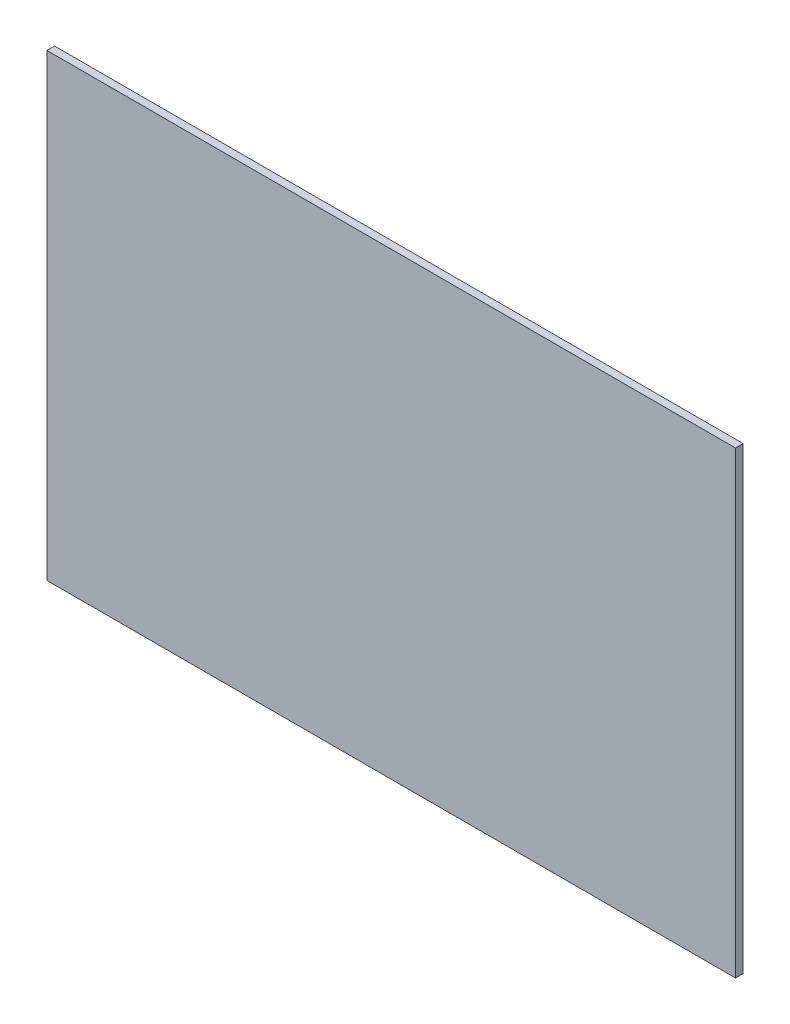
ISO-10303-21;
HEADER;
FILE_DESCRIPTION(('STEP AP214'),'2;1');
FILE_NAME('part.step','',(''),(''),'','','');
FILE_SCHEMA(('AUTOMOTIVE_DESIGN { 1 0 10303 214 1 1 1 1 }'));
ENDSEC;
DATA;
#1=APPLICATION_CONTEXT('core data for automotive mechanical design processes');
#2=APPLICATION_PROTOCOL_DEFINITION('international standard','automotive_design',2000,#1);
#3=PRODUCT_CONTEXT('',#1,'mechanical');
#4=PRODUCT('Part','Part','',(#3));
#5=PRODUCT_RELATED_PRODUCT_CATEGORY('part','',(#4));
#6=PRODUCT_DEFINITION_FORMATION('','',#4);
#7=PRODUCT_DEFINITION_CONTEXT('part definition',#1,'design');
#8=PRODUCT_DEFINITION('design','',#6,#7);
#9=PRODUCT_DEFINITION_SHAPE('','',#8);
#10=(LENGTH_UNIT() NAMED_UNIT(*) SI_UNIT(.MILLI.,.METRE.));
#11=(NAMED_UNIT(*) PLANE_ANGLE_UNIT() SI_UNIT($,.RADIAN.));
#12=(NAMED_UNIT(*) SI_UNIT($,.STERADIAN.) SOLID_ANGLE_UNIT());
#13=UNCERTAINTY_MEASURE_WITH_UNIT(LENGTH_MEASURE(1.E-05),#10,'distance_accuracy_value','');
#14=(GEOMETRIC_REPRESENTATION_CONTEXT(3) GLOBAL_UNCERTAINTY_ASSIGNED_CONTEXT((#13)) GLOBAL_UNIT_ASSIGNED_CONTEXT((#10,
#11,#12)) REPRESENTATION_CONTEXT('',''));
#15=CARTESIAN_POINT('',(0.,0.,0.));
#16=DIRECTION('',(0.,0.,1.));
#17=DIRECTION('',(1.,0.,0.));
#18=AXIS2_PLACEMENT_3D('',#15,#16,#17);
#19=CARTESIAN_POINT('',(-65.6500800559799,67.6742385786802,3.));
#20=DIRECTION('',(1.,0.,0.));
#21=DIRECTION('',(0.,1.,0.));
#22=AXIS2_PLACEMENT_3D('',#19,#20,#21);
#23=PLANE('',#22);
#24=DIRECTION('',(0.,-1.,0.));
#25=VECTOR('',#24,1.);
#26=CARTESIAN_POINT('',(-65.6500800559799,67.6742385786802,0.));
#27=LINE('',#26,#25);
#28=CARTESIAN_POINT('',(-65.6500800559799,67.6742385786802,0.));
#29=VERTEX_POINT('',#28);
#30=CARTESIAN_POINT('',(-65.6500800559799,-112.32576142132,0.));
#31=VERTEX_POINT('',#30);
#32=EDGE_CURVE('E96',#29,#31,#27,.T.);
#33=ORIENTED_EDGE('',*,*,#32,.T.);
#34=DIRECTION('',(0.,0.,-1.));
#35=VECTOR('',#34,1.);
#36=CARTESIAN_POINT('',(-65.6500800559799,-112.32576142132,3.));
#37=LINE('',#36,#35);
#38=CARTESIAN_POINT('',(-65.6500800559799,-112.32576142132,3.));
#39=VERTEX_POINT('',#38);
#40=EDGE_CURVE('E11',#39,#31,#37,.T.);
#41=ORIENTED_EDGE('',*,*,#40,.F.);
#42=DIRECTION('',(0.,-1.,0.));
#43=VECTOR('',#42,1.);
#44=CARTESIAN_POINT('',(-65.6500800559799,67.6742385786802,3.));
#45=LINE('',#44,#43);
#46=CARTESIAN_POINT('',(-65.6500800559799,67.6742385786802,3.));
#47=VERTEX_POINT('',#46);
#48=EDGE_CURVE('E84',#47,#39,#45,.T.);
#49=ORIENTED_EDGE('',*,*,#48,.F.);
#50=DIRECTION('',(0.,0.,-1.));
#51=VECTOR('',#50,1.);
#52=CARTESIAN_POINT('',(-65.6500800559799,67.6742385786802,3.));
#53=LINE('',#52,#51);
#54=EDGE_CURVE('E92',#47,#29,#53,.T.);
#55=ORIENTED_EDGE('',*,*,#54,.T.);
#56=EDGE_LOOP('',(#33,#41,#49,#55));
#57=FACE_BOUND('',#56,.T.);
#58=ADVANCED_FACE('F33',(#57),#23,.F.);
#59=CARTESIAN_POINT('',(-65.6500800559799,-112.32576142132,3.));
#60=DIRECTION('',(0.,1.,0.));
#61=DIRECTION('',(0.,0.,1.));
#62=AXIS2_PLACEMENT_3D('',#59,#60,#61);
#63=PLANE('',#62);
#64=DIRECTION('',(1.,0.,0.));
#65=VECTOR('',#64,1.);
#66=CARTESIAN_POINT('',(-65.6500800559799,-112.32576142132,0.));
#67=LINE('',#66,#65);
#68=CARTESIAN_POINT('',(204.34991994402,-112.32576142132,0.));
#69=VERTEX_POINT('',#68);
#70=EDGE_CURVE('E88',#31,#69,#67,.T.);
#71=ORIENTED_EDGE('',*,*,#70,.T.);
#72=DIRECTION('',(0.,0.,-1.));
#73=VECTOR('',#72,1.);
#74=CARTESIAN_POINT('',(204.34991994402,-112.32576142132,3.));
#75=LINE('',#74,#73);
#76=CARTESIAN_POINT('',(204.34991994402,-112.32576142132,3.));
#77=VERTEX_POINT('',#76);
#78=EDGE_CURVE('E41',#77,#69,#75,.T.);
#79=ORIENTED_EDGE('',*,*,#78,.F.);
#80=DIRECTION('',(1.,0.,0.));
#81=VECTOR('',#80,1.);
#82=CARTESIAN_POINT('',(-65.6500800559799,-112.32576142132,3.));
#83=LINE('',#82,#81);
#84=EDGE_CURVE('E79',#39,#77,#83,.T.);
#85=ORIENTED_EDGE('',*,*,#84,.F.);
#86=ORIENTED_EDGE('',*,*,#40,.T.);
#87=EDGE_LOOP('',(#71,#79,#85,#86));
#88=FACE_BOUND('',#87,.T.);
#89=ADVANCED_FACE('F87',(#88),#63,.F.);
#90=CARTESIAN_POINT('',(204.34991994402,67.6742385786802,3.));
#91=DIRECTION('',(-1.,0.,0.));
#92=DIRECTION('',(0.,0.,1.));
#93=AXIS2_PLACEMENT_3D('',#90,#91,#92);
#94=PLANE('',#93);
#95=DIRECTION('',(0.,1.,0.));
#96=VECTOR('',#95,1.);
#97=CARTESIAN_POINT('',(204.34991994402,67.6742385786802,0.));
#98=LINE('',#97,#96);
#99=CARTESIAN_POINT('',(204.34991994402,67.6742385786802,0.));
#100=VERTEX_POINT('',#99);
#101=EDGE_CURVE('E66',#69,#100,#98,.T.);
#102=ORIENTED_EDGE('',*,*,#101,.T.);
#103=DIRECTION('',(0.,0.,-1.));
#104=VECTOR('',#103,1.);
#105=CARTESIAN_POINT('',(204.34991994402,67.6742385786802,3.));
#106=LINE('',#105,#104);
#107=CARTESIAN_POINT('',(204.34991994402,67.6742385786802,3.));
#108=VERTEX_POINT('',#107);
#109=EDGE_CURVE('E89',#108,#100,#106,.T.);
#110=ORIENTED_EDGE('',*,*,#109,.F.);
#111=DIRECTION('',(0.,1.,0.));
#112=VECTOR('',#111,1.);
#113=CARTESIAN_POINT('',(204.34991994402,67.6742385786802,3.));
#114=LINE('',#113,#112);
#115=EDGE_CURVE('E82',#77,#108,#114,.T.);
#116=ORIENTED_EDGE('',*,*,#115,.F.);
#117=ORIENTED_EDGE('',*,*,#78,.T.);
#118=EDGE_LOOP('',(#102,#110,#116,#117));
#119=FACE_BOUND('',#118,.T.);
#120=ADVANCED_FACE('F90',(#119),#94,.F.);
#121=CARTESIAN_POINT('',(-65.6500800559799,67.6742385786802,3.));
#122=DIRECTION('',(0.,-1.,0.));
#123=DIRECTION('',(0.,0.,-1.));
#124=AXIS2_PLACEMENT_3D('',#121,#122,#123);
#125=PLANE('',#124);
#126=DIRECTION('',(-1.,0.,0.));
#127=VECTOR('',#126,1.);
#128=CARTESIAN_POINT('',(-65.6500800559799,67.6742385786802,0.));
#129=LINE('',#128,#127);
#130=EDGE_CURVE('E72',#100,#29,#129,.T.);
#131=ORIENTED_EDGE('',*,*,#130,.T.);
#132=ORIENTED_EDGE('',*,*,#54,.F.);
#133=DIRECTION('',(-1.,0.,0.));
#134=VECTOR('',#133,1.);
#135=CARTESIAN_POINT('',(-65.6500800559799,67.6742385786802,3.));
#136=LINE('',#135,#134);
#137=EDGE_CURVE('E49',#108,#47,#136,.T.);
#138=ORIENTED_EDGE('',*,*,#137,.F.);
#139=ORIENTED_EDGE('',*,*,#109,.T.);
#140=EDGE_LOOP('',(#131,#132,#138,#139));
#141=FACE_BOUND('',#140,.T.);
#142=ADVANCED_FACE('F103',(#141),#125,.F.);
#143=CARTESIAN_POINT('',(0.,0.,3.));
#144=DIRECTION('',(0.,0.,1.));
#145=DIRECTION('',(1.,0.,0.));
#146=AXIS2_PLACEMENT_3D('',#143,#144,#145);
#147=PLANE('',#146);
#148=ORIENTED_EDGE('',*,*,#48,.T.);
#149=ORIENTED_EDGE('',*,*,#84,.T.);
#150=ORIENTED_EDGE('',*,*,#115,.T.);
#151=ORIENTED_EDGE('',*,*,#137,.T.);
#152=EDGE_LOOP('',(#148,#149,#150,#151));
#153=FACE_BOUND('',#152,.T.);
#154=ADVANCED_FACE('F80',(#153),#147,.T.);
#155=CARTESIAN_POINT('',(0.,0.,0.));
#156=DIRECTION('',(0.,0.,1.));
#157=DIRECTION('',(1.,0.,0.));
#158=AXIS2_PLACEMENT_3D('',#155,#156,#157);
#159=PLANE('',#158);
#160=ORIENTED_EDGE('',*,*,#32,.F.);
#161=ORIENTED_EDGE('',*,*,#130,.F.);
#162=ORIENTED_EDGE('',*,*,#101,.F.);
#163=ORIENTED_EDGE('',*,*,#70,.F.);
#164=EDGE_LOOP('',(#160,#161,#162,#163));
#165=FACE_BOUND('',#164,.T.);
#166=ADVANCED_FACE('F106',(#165),#159,.F.);
#167=CLOSED_SHELL('',(#58,#89,#120,#142,#154,#166));
#168=MANIFOLD_SOLID_BREP('B2',#167);
#169=ADVANCED_BREP_SHAPE_REPRESENTATION('',(#18,#168),#14);
#170=SHAPE_DEFINITION_REPRESENTATION(#9,#169);
ENDSEC;
END-ISO-10303-21;
